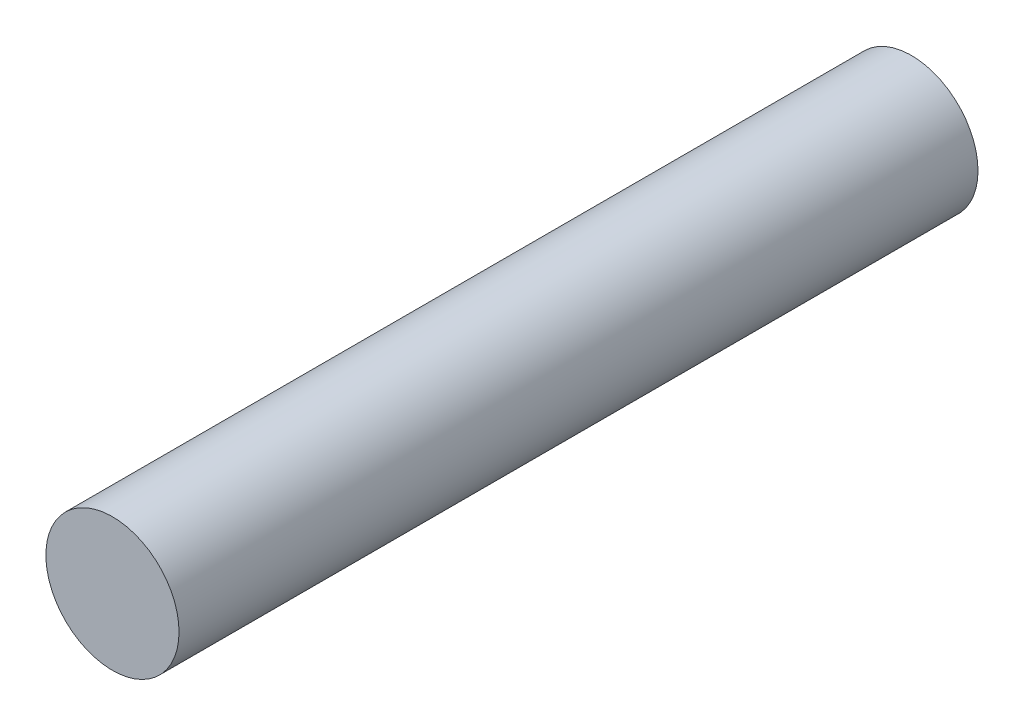
ISO-10303-21;
HEADER;
FILE_DESCRIPTION(('STEP AP214'),'2;1');
FILE_NAME('part.step','',(''),(''),'','','');
FILE_SCHEMA(('AUTOMOTIVE_DESIGN { 1 0 10303 214 1 1 1 1 }'));
ENDSEC;
DATA;
#1=APPLICATION_CONTEXT('core data for automotive mechanical design processes');
#2=APPLICATION_PROTOCOL_DEFINITION('international standard','automotive_design',2000,#1);
#3=PRODUCT_CONTEXT('',#1,'mechanical');
#4=PRODUCT('Part','Part','',(#3));
#5=PRODUCT_RELATED_PRODUCT_CATEGORY('part','',(#4));
#6=PRODUCT_DEFINITION_FORMATION('','',#4);
#7=PRODUCT_DEFINITION_CONTEXT('part definition',#1,'design');
#8=PRODUCT_DEFINITION('design','',#6,#7);
#9=PRODUCT_DEFINITION_SHAPE('','',#8);
#10=(LENGTH_UNIT() NAMED_UNIT(*) SI_UNIT(.MILLI.,.METRE.));
#11=(NAMED_UNIT(*) PLANE_ANGLE_UNIT() SI_UNIT($,.RADIAN.));
#12=(NAMED_UNIT(*) SI_UNIT($,.STERADIAN.) SOLID_ANGLE_UNIT());
#13=UNCERTAINTY_MEASURE_WITH_UNIT(LENGTH_MEASURE(1.E-05),#10,'distance_accuracy_value','');
#14=(GEOMETRIC_REPRESENTATION_CONTEXT(3) GLOBAL_UNCERTAINTY_ASSIGNED_CONTEXT((#13)) GLOBAL_UNIT_ASSIGNED_CONTEXT((#10,
#11,#12)) REPRESENTATION_CONTEXT('',''));
#15=CARTESIAN_POINT('',(0.,0.,0.));
#16=DIRECTION('',(0.,0.,1.));
#17=DIRECTION('',(1.,0.,0.));
#18=AXIS2_PLACEMENT_3D('',#15,#16,#17);
#19=CARTESIAN_POINT('',(0.,0.,15.));
#20=DIRECTION('',(0.,0.,-1.));
#21=DIRECTION('',(-1.,0.,0.));
#22=AXIS2_PLACEMENT_3D('',#19,#20,#21);
#23=CYLINDRICAL_SURFACE('',#22,2.5);
#24=CARTESIAN_POINT('',(0.,0.,15.));
#25=DIRECTION('',(0.,0.,1.));
#26=DIRECTION('',(1.,0.,0.));
#27=AXIS2_PLACEMENT_3D('',#24,#25,#26);
#28=CIRCLE('',#27,2.5);
#29=CARTESIAN_POINT('',(2.5,0.,15.));
#30=VERTEX_POINT('',#29);
#31=EDGE_CURVE('E10',#30,#30,#28,.T.);
#32=ORIENTED_EDGE('',*,*,#31,.F.);
#33=EDGE_LOOP('',(#32));
#34=FACE_BOUND('',#33,.T.);
#35=CARTESIAN_POINT('',(0.,0.,-15.));
#36=DIRECTION('',(0.,0.,1.));
#37=DIRECTION('',(1.,0.,0.));
#38=AXIS2_PLACEMENT_3D('',#35,#36,#37);
#39=CIRCLE('',#38,2.5);
#40=CARTESIAN_POINT('',(2.5,0.,-15.));
#41=VERTEX_POINT('',#40);
#42=EDGE_CURVE('E40',#41,#41,#39,.T.);
#43=ORIENTED_EDGE('',*,*,#42,.T.);
#44=EDGE_LOOP('',(#43));
#45=FACE_BOUND('',#44,.T.);
#46=ADVANCED_FACE('F37',(#34,#45),#23,.T.);
#47=CARTESIAN_POINT('',(0.,0.,15.));
#48=DIRECTION('',(0.,0.,1.));
#49=DIRECTION('',(1.,0.,0.));
#50=AXIS2_PLACEMENT_3D('',#47,#48,#49);
#51=PLANE('',#50);
#52=ORIENTED_EDGE('',*,*,#31,.T.);
#53=EDGE_LOOP('',(#52));
#54=FACE_BOUND('',#53,.T.);
#55=ADVANCED_FACE('F54',(#54),#51,.T.);
#56=CARTESIAN_POINT('',(0.,0.,-15.));
#57=DIRECTION('',(0.,0.,1.));
#58=DIRECTION('',(1.,0.,0.));
#59=AXIS2_PLACEMENT_3D('',#56,#57,#58);
#60=PLANE('',#59);
#61=ORIENTED_EDGE('',*,*,#42,.F.);
#62=EDGE_LOOP('',(#61));
#63=FACE_BOUND('',#62,.T.);
#64=ADVANCED_FACE('F52',(#63),#60,.F.);
#65=CLOSED_SHELL('',(#46,#55,#64));
#66=MANIFOLD_SOLID_BREP('B2',#65);
#67=ADVANCED_BREP_SHAPE_REPRESENTATION('',(#18,#66),#14);
#68=SHAPE_DEFINITION_REPRESENTATION(#9,#67);
ENDSEC;
END-ISO-10303-21;
